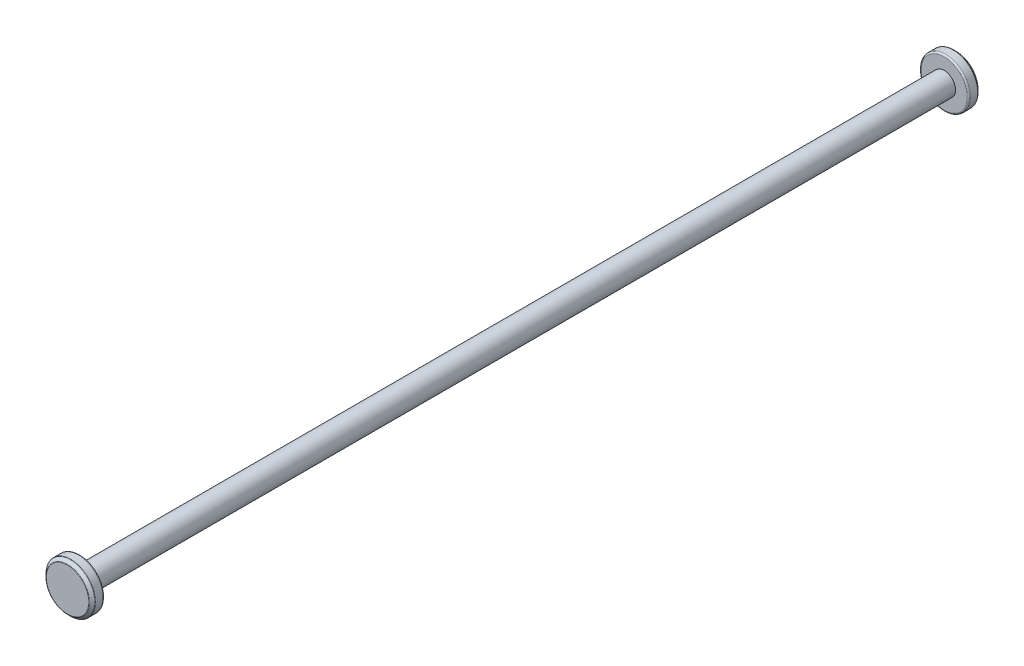
ISO-10303-21;
HEADER;
FILE_DESCRIPTION(('STEP AP214'),'2;1');
FILE_NAME('part.step','',(''),(''),'','','');
FILE_SCHEMA(('AUTOMOTIVE_DESIGN { 1 0 10303 214 1 1 1 1 }'));
ENDSEC;
DATA;
#1=APPLICATION_CONTEXT('core data for automotive mechanical design processes');
#2=APPLICATION_PROTOCOL_DEFINITION('international standard','automotive_design',2000,#1);
#3=PRODUCT_CONTEXT('',#1,'mechanical');
#4=PRODUCT('Part','Part','',(#3));
#5=PRODUCT_RELATED_PRODUCT_CATEGORY('part','',(#4));
#6=PRODUCT_DEFINITION_FORMATION('','',#4);
#7=PRODUCT_DEFINITION_CONTEXT('part definition',#1,'design');
#8=PRODUCT_DEFINITION('design','',#6,#7);
#9=PRODUCT_DEFINITION_SHAPE('','',#8);
#10=(LENGTH_UNIT() NAMED_UNIT(*) SI_UNIT(.MILLI.,.METRE.));
#11=(NAMED_UNIT(*) PLANE_ANGLE_UNIT() SI_UNIT($,.RADIAN.));
#12=(NAMED_UNIT(*) SI_UNIT($,.STERADIAN.) SOLID_ANGLE_UNIT());
#13=UNCERTAINTY_MEASURE_WITH_UNIT(LENGTH_MEASURE(1.E-05),#10,'distance_accuracy_value','');
#14=(GEOMETRIC_REPRESENTATION_CONTEXT(3) GLOBAL_UNCERTAINTY_ASSIGNED_CONTEXT((#13)) GLOBAL_UNIT_ASSIGNED_CONTEXT((#10,
#11,#12)) REPRESENTATION_CONTEXT('',''));
#15=CARTESIAN_POINT('',(0.,0.,0.));
#16=DIRECTION('',(0.,0.,1.));
#17=DIRECTION('',(1.,0.,0.));
#18=AXIS2_PLACEMENT_3D('',#15,#16,#17);
#19=CARTESIAN_POINT('',(0.,0.,70.25));
#20=DIRECTION('',(0.,0.,-1.));
#21=DIRECTION('',(-1.,0.,0.));
#22=AXIS2_PLACEMENT_3D('',#19,#20,#21);
#23=CYLINDRICAL_SURFACE('',#22,1.85);
#24=CARTESIAN_POINT('',(0.,0.,70.25));
#25=DIRECTION('',(0.,0.,1.));
#26=DIRECTION('',(1.,0.,0.));
#27=AXIS2_PLACEMENT_3D('',#24,#25,#26);
#28=CIRCLE('',#27,1.85);
#29=CARTESIAN_POINT('',(1.85,0.,70.25));
#30=VERTEX_POINT('',#29);
#31=EDGE_CURVE('E80',#30,#30,#28,.T.);
#32=ORIENTED_EDGE('',*,*,#31,.F.);
#33=EDGE_LOOP('',(#32));
#34=FACE_BOUND('',#33,.T.);
#35=CARTESIAN_POINT('',(0.,0.,-70.25));
#36=DIRECTION('',(0.,0.,1.));
#37=DIRECTION('',(1.,0.,0.));
#38=AXIS2_PLACEMENT_3D('',#35,#36,#37);
#39=CIRCLE('',#38,1.85);
#40=CARTESIAN_POINT('',(1.85,0.,-70.25));
#41=VERTEX_POINT('',#40);
#42=EDGE_CURVE('E81',#41,#41,#39,.T.);
#43=ORIENTED_EDGE('',*,*,#42,.T.);
#44=EDGE_LOOP('',(#43));
#45=FACE_BOUND('',#44,.T.);
#46=ADVANCED_FACE('F36',(#34,#45),#23,.T.);
#47=CARTESIAN_POINT('',(0.,0.,-72.25));
#48=DIRECTION('',(0.,0.,1.));
#49=DIRECTION('',(1.,0.,0.));
#50=AXIS2_PLACEMENT_3D('',#47,#48,#49);
#51=CYLINDRICAL_SURFACE('',#50,4.);
#52=CARTESIAN_POINT('',(0.,0.,-71.6982233047034));
#53=DIRECTION('',(0.,0.,-1.));
#54=DIRECTION('',(-1.,0.,0.));
#55=AXIS2_PLACEMENT_3D('',#52,#53,#54);
#56=CIRCLE('',#55,4.);
#57=CARTESIAN_POINT('',(-4.,0.,-71.6982233047034));
#58=VERTEX_POINT('',#57);
#59=EDGE_CURVE('E71',#58,#58,#56,.F.);
#60=ORIENTED_EDGE('',*,*,#59,.T.);
#61=EDGE_LOOP('',(#60));
#62=FACE_BOUND('',#61,.T.);
#63=CARTESIAN_POINT('',(0.,0.,-70.5));
#64=DIRECTION('',(0.,0.,-1.));
#65=DIRECTION('',(-1.,0.,0.));
#66=AXIS2_PLACEMENT_3D('',#63,#64,#65);
#67=CIRCLE('',#66,4.);
#68=CARTESIAN_POINT('',(-4.,0.,-70.5));
#69=VERTEX_POINT('',#68);
#70=EDGE_CURVE('E77',#69,#69,#67,.T.);
#71=ORIENTED_EDGE('',*,*,#70,.T.);
#72=EDGE_LOOP('',(#71));
#73=FACE_BOUND('',#72,.T.);
#74=ADVANCED_FACE('F91',(#62,#73),#51,.T.);
#75=CARTESIAN_POINT('',(0.,0.,-72.25));
#76=DIRECTION('',(0.,0.,-1.));
#77=DIRECTION('',(-1.,0.,0.));
#78=AXIS2_PLACEMENT_3D('',#75,#76,#77);
#79=PLANE('',#78);
#80=CARTESIAN_POINT('',(0.,0.,-72.25));
#81=DIRECTION('',(0.,0.,-1.));
#82=DIRECTION('',(-1.,0.,0.));
#83=AXIS2_PLACEMENT_3D('',#80,#81,#82);
#84=CIRCLE('',#83,3.44822330470338);
#85=CARTESIAN_POINT('',(-3.44822330470338,0.,-72.25));
#86=VERTEX_POINT('',#85);
#87=EDGE_CURVE('E62',#86,#86,#84,.T.);
#88=ORIENTED_EDGE('',*,*,#87,.T.);
#89=EDGE_LOOP('',(#88));
#90=FACE_BOUND('',#89,.T.);
#91=ADVANCED_FACE('F98',(#90),#79,.T.);
#92=CARTESIAN_POINT('',(0.,0.,-70.25));
#93=DIRECTION('',(0.,0.,-1.));
#94=DIRECTION('',(-1.,0.,0.));
#95=AXIS2_PLACEMENT_3D('',#92,#93,#94);
#96=PLANE('',#95);
#97=CARTESIAN_POINT('',(0.,0.,-70.25));
#98=DIRECTION('',(0.,0.,-1.));
#99=DIRECTION('',(-1.,0.,0.));
#100=AXIS2_PLACEMENT_3D('',#97,#98,#99);
#101=CIRCLE('',#100,3.75);
#102=CARTESIAN_POINT('',(-3.75,0.,-70.25));
#103=VERTEX_POINT('',#102);
#104=EDGE_CURVE('E74',#103,#103,#101,.F.);
#105=ORIENTED_EDGE('',*,*,#104,.T.);
#106=EDGE_LOOP('',(#105));
#107=FACE_BOUND('',#106,.T.);
#108=ORIENTED_EDGE('',*,*,#42,.F.);
#109=EDGE_LOOP('',(#108));
#110=FACE_BOUND('',#109,.T.);
#111=ADVANCED_FACE('F95',(#107,#110),#96,.F.);
#112=CARTESIAN_POINT('',(0.,0.,-72.25));
#113=DIRECTION('',(0.,0.,1.));
#114=DIRECTION('',(1.,0.,0.));
#115=AXIS2_PLACEMENT_3D('',#112,#113,#114);
#116=CONICAL_SURFACE('',#115,3.50000000000002,0.785398163397445);
#117=CARTESIAN_POINT('',(0.,0.,-71.7866116523517));
#118=DIRECTION('',(0.,0.,1.));
#119=DIRECTION('',(1.,0.,0.));
#120=AXIS2_PLACEMENT_3D('',#117,#118,#119);
#121=CIRCLE('',#120,3.96338834764832);
#122=CARTESIAN_POINT('',(3.96338834764832,0.,-71.7866116523517));
#123=VERTEX_POINT('',#122);
#124=EDGE_CURVE('E65',#123,#123,#121,.F.);
#125=ORIENTED_EDGE('',*,*,#124,.T.);
#126=EDGE_LOOP('',(#125));
#127=FACE_BOUND('',#126,.T.);
#128=CARTESIAN_POINT('',(0.,0.,-72.2133883476483));
#129=DIRECTION('',(0.,0.,-1.));
#130=DIRECTION('',(-1.,0.,0.));
#131=AXIS2_PLACEMENT_3D('',#128,#129,#130);
#132=CIRCLE('',#131,3.5366116523517);
#133=CARTESIAN_POINT('',(-3.5366116523517,0.,-72.2133883476483));
#134=VERTEX_POINT('',#133);
#135=EDGE_CURVE('E68',#134,#134,#132,.F.);
#136=ORIENTED_EDGE('',*,*,#135,.T.);
#137=EDGE_LOOP('',(#136));
#138=FACE_BOUND('',#137,.T.);
#139=ADVANCED_FACE('F97',(#127,#138),#116,.T.);
#140=CARTESIAN_POINT('',(0.,0.,-70.5));
#141=DIRECTION('',(0.,0.,-1.));
#142=DIRECTION('',(-1.,0.,0.));
#143=AXIS2_PLACEMENT_3D('',#140,#141,#142);
#144=TOROIDAL_SURFACE('',#143,3.75,0.25);
#145=ORIENTED_EDGE('',*,*,#104,.F.);
#146=EDGE_LOOP('',(#145));
#147=FACE_BOUND('',#146,.T.);
#148=ORIENTED_EDGE('',*,*,#70,.F.);
#149=EDGE_LOOP('',(#148));
#150=FACE_BOUND('',#149,.T.);
#151=ADVANCED_FACE('F105',(#147,#150),#144,.T.);
#152=CARTESIAN_POINT('',(0.,0.,-71.6982233047034));
#153=DIRECTION('',(0.,0.,-1.));
#154=DIRECTION('',(-1.,0.,0.));
#155=AXIS2_PLACEMENT_3D('',#152,#153,#154);
#156=TOROIDAL_SURFACE('',#155,3.875,0.125);
#157=ORIENTED_EDGE('',*,*,#124,.F.);
#158=EDGE_LOOP('',(#157));
#159=FACE_BOUND('',#158,.T.);
#160=ORIENTED_EDGE('',*,*,#59,.F.);
#161=EDGE_LOOP('',(#160));
#162=FACE_BOUND('',#161,.T.);
#163=ADVANCED_FACE('F121',(#159,#162),#156,.T.);
#164=CARTESIAN_POINT('',(0.,0.,-72.125));
#165=DIRECTION('',(0.,0.,-1.));
#166=DIRECTION('',(-1.,0.,0.));
#167=AXIS2_PLACEMENT_3D('',#164,#165,#166);
#168=TOROIDAL_SURFACE('',#167,3.44822330470338,0.125);
#169=ORIENTED_EDGE('',*,*,#135,.F.);
#170=EDGE_LOOP('',(#169));
#171=FACE_BOUND('',#170,.T.);
#172=ORIENTED_EDGE('',*,*,#87,.F.);
#173=EDGE_LOOP('',(#172));
#174=FACE_BOUND('',#173,.T.);
#175=ADVANCED_FACE('F125',(#171,#174),#168,.T.);
#176=CARTESIAN_POINT('',(0.,0.,72.25));
#177=DIRECTION('',(0.,0.,-1.));
#178=DIRECTION('',(-1.,0.,0.));
#179=AXIS2_PLACEMENT_3D('',#176,#177,#178);
#180=CYLINDRICAL_SURFACE('',#179,4.);
#181=CARTESIAN_POINT('',(0.,0.,71.6982233047033));
#182=DIRECTION('',(0.,0.,1.));
#183=DIRECTION('',(1.,0.,0.));
#184=AXIS2_PLACEMENT_3D('',#181,#182,#183);
#185=CIRCLE('',#184,4.);
#186=CARTESIAN_POINT('',(4.,0.,71.6982233047033));
#187=VERTEX_POINT('',#186);
#188=EDGE_CURVE('E51',#187,#187,#185,.F.);
#189=ORIENTED_EDGE('',*,*,#188,.T.);
#190=EDGE_LOOP('',(#189));
#191=FACE_BOUND('',#190,.T.);
#192=CARTESIAN_POINT('',(0.,0.,70.5));
#193=DIRECTION('',(0.,0.,1.));
#194=DIRECTION('',(1.,0.,0.));
#195=AXIS2_PLACEMENT_3D('',#192,#193,#194);
#196=CIRCLE('',#195,4.);
#197=CARTESIAN_POINT('',(4.,0.,70.5));
#198=VERTEX_POINT('',#197);
#199=EDGE_CURVE('E56',#198,#198,#196,.T.);
#200=ORIENTED_EDGE('',*,*,#199,.T.);
#201=EDGE_LOOP('',(#200));
#202=FACE_BOUND('',#201,.T.);
#203=ADVANCED_FACE('F129',(#191,#202),#180,.T.);
#204=CARTESIAN_POINT('',(0.,0.,72.25));
#205=DIRECTION('',(0.,0.,1.));
#206=DIRECTION('',(-1.,0.,0.));
#207=AXIS2_PLACEMENT_3D('',#204,#205,#206);
#208=PLANE('',#207);
#209=CARTESIAN_POINT('',(0.,0.,72.25));
#210=DIRECTION('',(0.,0.,1.));
#211=DIRECTION('',(1.,0.,0.));
#212=AXIS2_PLACEMENT_3D('',#209,#210,#211);
#213=CIRCLE('',#212,3.44822330470336);
#214=CARTESIAN_POINT('',(3.44822330470336,0.,72.25));
#215=VERTEX_POINT('',#214);
#216=EDGE_CURVE('E10',#215,#215,#213,.T.);
#217=ORIENTED_EDGE('',*,*,#216,.T.);
#218=EDGE_LOOP('',(#217));
#219=FACE_BOUND('',#218,.T.);
#220=ADVANCED_FACE('F151',(#219),#208,.T.);
#221=CARTESIAN_POINT('',(0.,0.,70.25));
#222=DIRECTION('',(0.,0.,1.));
#223=DIRECTION('',(-1.,0.,0.));
#224=AXIS2_PLACEMENT_3D('',#221,#222,#223);
#225=PLANE('',#224);
#226=CARTESIAN_POINT('',(0.,0.,70.25));
#227=DIRECTION('',(0.,0.,1.));
#228=DIRECTION('',(1.,0.,0.));
#229=AXIS2_PLACEMENT_3D('',#226,#227,#228);
#230=CIRCLE('',#229,3.75);
#231=CARTESIAN_POINT('',(3.75,0.,70.25));
#232=VERTEX_POINT('',#231);
#233=EDGE_CURVE('E59',#232,#232,#230,.F.);
#234=ORIENTED_EDGE('',*,*,#233,.T.);
#235=EDGE_LOOP('',(#234));
#236=FACE_BOUND('',#235,.T.);
#237=ORIENTED_EDGE('',*,*,#31,.T.);
#238=EDGE_LOOP('',(#237));
#239=FACE_BOUND('',#238,.T.);
#240=ADVANCED_FACE('F87',(#236,#239),#225,.F.);
#241=CARTESIAN_POINT('',(0.,0.,71.75));
#242=DIRECTION('',(0.,0.,-1.));
#243=DIRECTION('',(-1.,0.,0.));
#244=AXIS2_PLACEMENT_3D('',#241,#242,#243);
#245=CONICAL_SURFACE('',#244,4.,0.785398163397438);
#246=CARTESIAN_POINT('',(0.,0.,71.7866116523517));
#247=DIRECTION('',(0.,0.,1.));
#248=DIRECTION('',(1.,0.,0.));
#249=AXIS2_PLACEMENT_3D('',#246,#247,#248);
#250=CIRCLE('',#249,3.96338834764832);
#251=CARTESIAN_POINT('',(3.96338834764832,0.,71.7866116523517));
#252=VERTEX_POINT('',#251);
#253=EDGE_CURVE('E43',#252,#252,#250,.T.);
#254=ORIENTED_EDGE('',*,*,#253,.T.);
#255=EDGE_LOOP('',(#254));
#256=FACE_BOUND('',#255,.T.);
#257=CARTESIAN_POINT('',(0.,0.,72.2133883476483));
#258=DIRECTION('',(0.,0.,1.));
#259=DIRECTION('',(1.,0.,0.));
#260=AXIS2_PLACEMENT_3D('',#257,#258,#259);
#261=CIRCLE('',#260,3.53661165235167);
#262=CARTESIAN_POINT('',(3.53661165235167,0.,72.2133883476483));
#263=VERTEX_POINT('',#262);
#264=EDGE_CURVE('E47',#263,#263,#261,.F.);
#265=ORIENTED_EDGE('',*,*,#264,.T.);
#266=EDGE_LOOP('',(#265));
#267=FACE_BOUND('',#266,.T.);
#268=ADVANCED_FACE('F131',(#256,#267),#245,.T.);
#269=CARTESIAN_POINT('',(0.,0.,70.5));
#270=DIRECTION('',(0.,0.,1.));
#271=DIRECTION('',(1.,0.,0.));
#272=AXIS2_PLACEMENT_3D('',#269,#270,#271);
#273=TOROIDAL_SURFACE('',#272,3.75,0.25);
#274=ORIENTED_EDGE('',*,*,#199,.F.);
#275=EDGE_LOOP('',(#274));
#276=FACE_BOUND('',#275,.T.);
#277=ORIENTED_EDGE('',*,*,#233,.F.);
#278=EDGE_LOOP('',(#277));
#279=FACE_BOUND('',#278,.T.);
#280=ADVANCED_FACE('F136',(#276,#279),#273,.T.);
#281=CARTESIAN_POINT('',(0.,0.,71.6982233047033));
#282=DIRECTION('',(0.,0.,1.));
#283=DIRECTION('',(1.,0.,0.));
#284=AXIS2_PLACEMENT_3D('',#281,#282,#283);
#285=TOROIDAL_SURFACE('',#284,3.875,0.125);
#286=ORIENTED_EDGE('',*,*,#253,.F.);
#287=EDGE_LOOP('',(#286));
#288=FACE_BOUND('',#287,.T.);
#289=ORIENTED_EDGE('',*,*,#188,.F.);
#290=EDGE_LOOP('',(#289));
#291=FACE_BOUND('',#290,.T.);
#292=ADVANCED_FACE('F138',(#288,#291),#285,.T.);
#293=CARTESIAN_POINT('',(0.,0.,72.125));
#294=DIRECTION('',(0.,0.,1.));
#295=DIRECTION('',(1.,0.,0.));
#296=AXIS2_PLACEMENT_3D('',#293,#294,#295);
#297=TOROIDAL_SURFACE('',#296,3.44822330470336,0.125);
#298=ORIENTED_EDGE('',*,*,#264,.F.);
#299=EDGE_LOOP('',(#298));
#300=FACE_BOUND('',#299,.T.);
#301=ORIENTED_EDGE('',*,*,#216,.F.);
#302=EDGE_LOOP('',(#301));
#303=FACE_BOUND('',#302,.T.);
#304=ADVANCED_FACE('F38',(#300,#303),#297,.T.);
#305=CLOSED_SHELL('',(#46,#74,#91,#111,#139,#151,#163,#175,#203,#220,#240,#268,#280,#292,#304));
#306=MANIFOLD_SOLID_BREP('B2',#305);
#307=ADVANCED_BREP_SHAPE_REPRESENTATION('',(#18,#306),#14);
#308=SHAPE_DEFINITION_REPRESENTATION(#9,#307);
ENDSEC;
END-ISO-10303-21;
